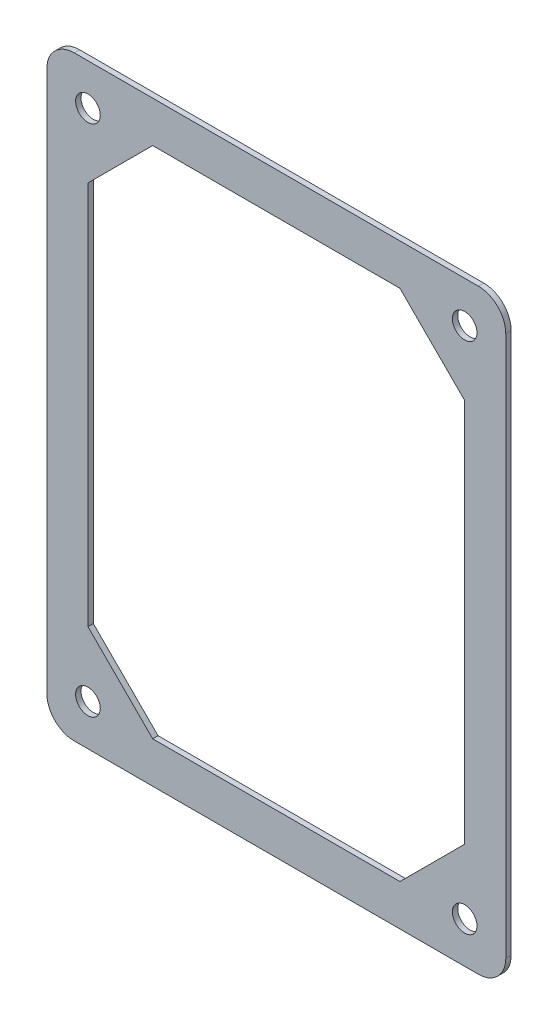
ISO-10303-21;
HEADER;
FILE_DESCRIPTION(('STEP AP214'),'2;1');
FILE_NAME('part.step','',(''),(''),'','','');
FILE_SCHEMA(('AUTOMOTIVE_DESIGN { 1 0 10303 214 1 1 1 1 }'));
ENDSEC;
DATA;
#1=APPLICATION_CONTEXT('core data for automotive mechanical design processes');
#2=APPLICATION_PROTOCOL_DEFINITION('international standard','automotive_design',2000,#1);
#3=PRODUCT_CONTEXT('',#1,'mechanical');
#4=PRODUCT('Part','Part','',(#3));
#5=PRODUCT_RELATED_PRODUCT_CATEGORY('part','',(#4));
#6=PRODUCT_DEFINITION_FORMATION('','',#4);
#7=PRODUCT_DEFINITION_CONTEXT('part definition',#1,'design');
#8=PRODUCT_DEFINITION('design','',#6,#7);
#9=PRODUCT_DEFINITION_SHAPE('','',#8);
#10=(LENGTH_UNIT() NAMED_UNIT(*) SI_UNIT(.MILLI.,.METRE.));
#11=(NAMED_UNIT(*) PLANE_ANGLE_UNIT() SI_UNIT($,.RADIAN.));
#12=(NAMED_UNIT(*) SI_UNIT($,.STERADIAN.) SOLID_ANGLE_UNIT());
#13=UNCERTAINTY_MEASURE_WITH_UNIT(LENGTH_MEASURE(1.E-05),#10,'distance_accuracy_value','');
#14=(GEOMETRIC_REPRESENTATION_CONTEXT(3) GLOBAL_UNCERTAINTY_ASSIGNED_CONTEXT((#13)) GLOBAL_UNIT_ASSIGNED_CONTEXT((#10,
#11,#12)) REPRESENTATION_CONTEXT('',''));
#15=CARTESIAN_POINT('',(0.,0.,0.));
#16=DIRECTION('',(0.,0.,1.));
#17=DIRECTION('',(1.,0.,0.));
#18=AXIS2_PLACEMENT_3D('',#15,#16,#17);
#19=CARTESIAN_POINT('',(-3.81000000000001,-104.14,1.));
#20=DIRECTION('',(0.,0.,1.));
#21=DIRECTION('',(1.,0.,0.));
#22=AXIS2_PLACEMENT_3D('',#19,#20,#21);
#23=PLANE('',#22);
#24=CARTESIAN_POINT('',(-6.35,-6.35,1.));
#25=DIRECTION('',(0.,0.,1.));
#26=DIRECTION('',(1.,0.,0.));
#27=AXIS2_PLACEMENT_3D('',#24,#25,#26);
#28=CIRCLE('',#27,2.286);
#29=CARTESIAN_POINT('',(-4.064,-6.35,1.));
#30=VERTEX_POINT('',#29);
#31=EDGE_CURVE('E211',#30,#30,#28,.T.);
#32=ORIENTED_EDGE('',*,*,#31,.F.);
#33=EDGE_LOOP('',(#32));
#34=FACE_BOUND('',#33,.T.);
#35=CARTESIAN_POINT('',(-76.200000000001,-101.6,1.));
#36=DIRECTION('',(0.,0.,1.));
#37=DIRECTION('',(1.,0.,0.));
#38=AXIS2_PLACEMENT_3D('',#35,#36,#37);
#39=CIRCLE('',#38,2.28600000000001);
#40=CARTESIAN_POINT('',(-73.914000000001,-101.6,1.));
#41=VERTEX_POINT('',#40);
#42=EDGE_CURVE('E223',#41,#41,#39,.T.);
#43=ORIENTED_EDGE('',*,*,#42,.F.);
#44=EDGE_LOOP('',(#43));
#45=FACE_BOUND('',#44,.T.);
#46=CARTESIAN_POINT('',(-3.81000000000001,-104.14,1.));
#47=DIRECTION('',(0.,0.,1.));
#48=DIRECTION('',(1.,0.,0.));
#49=AXIS2_PLACEMENT_3D('',#46,#47,#48);
#50=CIRCLE('',#49,5.08);
#51=CARTESIAN_POINT('',(-3.81000000000001,-109.22,1.));
#52=VERTEX_POINT('',#51);
#53=CARTESIAN_POINT('',(1.26999999999999,-104.14,1.));
#54=VERTEX_POINT('',#53);
#55=EDGE_CURVE('E235',#52,#54,#50,.T.);
#56=ORIENTED_EDGE('',*,*,#55,.T.);
#57=DIRECTION('',(0.,1.,0.));
#58=VECTOR('',#57,1.);
#59=CARTESIAN_POINT('',(1.26999999999999,-104.14,1.));
#60=LINE('',#59,#58);
#61=CARTESIAN_POINT('',(1.27,-3.81,1.));
#62=VERTEX_POINT('',#61);
#63=EDGE_CURVE('E238',#54,#62,#60,.T.);
#64=ORIENTED_EDGE('',*,*,#63,.T.);
#65=CARTESIAN_POINT('',(-3.81,-3.81,1.));
#66=DIRECTION('',(0.,0.,1.));
#67=DIRECTION('',(1.,0.,0.));
#68=AXIS2_PLACEMENT_3D('',#65,#66,#67);
#69=CIRCLE('',#68,5.08);
#70=CARTESIAN_POINT('',(-3.80999999999999,1.27,1.));
#71=VERTEX_POINT('',#70);
#72=EDGE_CURVE('E241',#62,#71,#69,.T.);
#73=ORIENTED_EDGE('',*,*,#72,.T.);
#74=DIRECTION('',(-1.,0.,0.));
#75=VECTOR('',#74,1.);
#76=CARTESIAN_POINT('',(-3.80999999999999,1.27,1.));
#77=LINE('',#76,#75);
#78=CARTESIAN_POINT('',(-78.74,1.27,1.));
#79=VERTEX_POINT('',#78);
#80=EDGE_CURVE('E243',#71,#79,#77,.T.);
#81=ORIENTED_EDGE('',*,*,#80,.T.);
#82=CARTESIAN_POINT('',(-78.74,-3.81,1.));
#83=DIRECTION('',(0.,0.,1.));
#84=DIRECTION('',(1.,0.,0.));
#85=AXIS2_PLACEMENT_3D('',#82,#83,#84);
#86=CIRCLE('',#85,5.08);
#87=CARTESIAN_POINT('',(-83.82,-3.80999999999999,1.));
#88=VERTEX_POINT('',#87);
#89=EDGE_CURVE('E245',#79,#88,#86,.T.);
#90=ORIENTED_EDGE('',*,*,#89,.T.);
#91=DIRECTION('',(0.,-1.,0.));
#92=VECTOR('',#91,1.);
#93=CARTESIAN_POINT('',(-83.82,-3.80999999999999,1.));
#94=LINE('',#93,#92);
#95=CARTESIAN_POINT('',(-83.82,-104.14,1.));
#96=VERTEX_POINT('',#95);
#97=EDGE_CURVE('E247',#88,#96,#94,.T.);
#98=ORIENTED_EDGE('',*,*,#97,.T.);
#99=CARTESIAN_POINT('',(-78.74,-104.14,1.));
#100=DIRECTION('',(0.,0.,1.));
#101=DIRECTION('',(1.,0.,0.));
#102=AXIS2_PLACEMENT_3D('',#99,#100,#101);
#103=CIRCLE('',#102,5.08);
#104=CARTESIAN_POINT('',(-78.74,-109.22,1.));
#105=VERTEX_POINT('',#104);
#106=EDGE_CURVE('E249',#96,#105,#103,.T.);
#107=ORIENTED_EDGE('',*,*,#106,.T.);
#108=DIRECTION('',(1.,0.,0.));
#109=VECTOR('',#108,1.);
#110=CARTESIAN_POINT('',(-78.74,-109.22,1.));
#111=LINE('',#110,#109);
#112=EDGE_CURVE('E251',#105,#52,#111,.T.);
#113=ORIENTED_EDGE('',*,*,#112,.T.);
#114=EDGE_LOOP('',(#56,#64,#73,#81,#90,#98,#107,#113));
#115=FACE_BOUND('',#114,.T.);
#116=CARTESIAN_POINT('',(-76.2,-6.35,1.));
#117=DIRECTION('',(0.,0.,1.));
#118=DIRECTION('',(1.,0.,0.));
#119=AXIS2_PLACEMENT_3D('',#116,#117,#118);
#120=CIRCLE('',#119,2.28600000000001);
#121=CARTESIAN_POINT('',(-73.914,-6.35,1.));
#122=VERTEX_POINT('',#121);
#123=EDGE_CURVE('E229',#122,#122,#120,.T.);
#124=ORIENTED_EDGE('',*,*,#123,.F.);
#125=EDGE_LOOP('',(#124));
#126=FACE_BOUND('',#125,.T.);
#127=CARTESIAN_POINT('',(-6.350000000001,-101.6,1.));
#128=DIRECTION('',(0.,0.,1.));
#129=DIRECTION('',(1.,0.,0.));
#130=AXIS2_PLACEMENT_3D('',#127,#128,#129);
#131=CIRCLE('',#130,2.286);
#132=CARTESIAN_POINT('',(-4.064000000001,-101.6,1.));
#133=VERTEX_POINT('',#132);
#134=EDGE_CURVE('E217',#133,#133,#131,.T.);
#135=ORIENTED_EDGE('',*,*,#134,.F.);
#136=EDGE_LOOP('',(#135));
#137=FACE_BOUND('',#136,.T.);
#138=DIRECTION('',(-0.707106781186551,-0.707106781186544,0.));
#139=VECTOR('',#138,1.);
#140=CARTESIAN_POINT('',(-76.2000000000001,-18.35,1.));
#141=LINE('',#140,#139);
#142=CARTESIAN_POINT('',(-64.2,-6.35,1.));
#143=VERTEX_POINT('',#142);
#144=CARTESIAN_POINT('',(-76.2000000000001,-18.35,1.));
#145=VERTEX_POINT('',#144);
#146=EDGE_CURVE('E154',#143,#145,#141,.T.);
#147=ORIENTED_EDGE('',*,*,#146,.F.);
#148=DIRECTION('',(-1.,0.,0.));
#149=VECTOR('',#148,1.);
#150=CARTESIAN_POINT('',(-64.2,-6.35,1.));
#151=LINE('',#150,#149);
#152=CARTESIAN_POINT('',(-18.35,-6.35,1.));
#153=VERTEX_POINT('',#152);
#154=EDGE_CURVE('E146',#153,#143,#151,.T.);
#155=ORIENTED_EDGE('',*,*,#154,.F.);
#156=DIRECTION('',(-0.707106781186544,0.707106781186551,0.));
#157=VECTOR('',#156,1.);
#158=CARTESIAN_POINT('',(-18.35,-6.35,1.));
#159=LINE('',#158,#157);
#160=CARTESIAN_POINT('',(-6.35000000000013,-18.35,1.));
#161=VERTEX_POINT('',#160);
#162=EDGE_CURVE('E179',#161,#153,#159,.T.);
#163=ORIENTED_EDGE('',*,*,#162,.F.);
#164=DIRECTION('',(0.,1.,0.));
#165=VECTOR('',#164,1.);
#166=CARTESIAN_POINT('',(-6.35000000000013,-18.35,1.));
#167=LINE('',#166,#165);
#168=CARTESIAN_POINT('',(-6.35000000000087,-89.6,1.));
#169=VERTEX_POINT('',#168);
#170=EDGE_CURVE('E177',#169,#161,#167,.T.);
#171=ORIENTED_EDGE('',*,*,#170,.F.);
#172=DIRECTION('',(0.707106781186551,0.707106781186544,0.));
#173=VECTOR('',#172,1.);
#174=CARTESIAN_POINT('',(-18.350000000001,-101.6,1.));
#175=LINE('',#174,#173);
#176=CARTESIAN_POINT('',(-18.350000000001,-101.6,1.));
#177=VERTEX_POINT('',#176);
#178=EDGE_CURVE('E175',#177,#169,#175,.T.);
#179=ORIENTED_EDGE('',*,*,#178,.F.);
#180=DIRECTION('',(1.,0.,0.));
#181=VECTOR('',#180,1.);
#182=CARTESIAN_POINT('',(-64.200000000001,-101.6,1.));
#183=LINE('',#182,#181);
#184=CARTESIAN_POINT('',(-64.200000000001,-101.6,1.));
#185=VERTEX_POINT('',#184);
#186=EDGE_CURVE('E173',#185,#177,#183,.T.);
#187=ORIENTED_EDGE('',*,*,#186,.F.);
#188=DIRECTION('',(0.707106781186544,-0.707106781186551,0.));
#189=VECTOR('',#188,1.);
#190=CARTESIAN_POINT('',(-76.2000000000009,-89.6,1.));
#191=LINE('',#190,#189);
#192=CARTESIAN_POINT('',(-76.2000000000009,-89.6,1.));
#193=VERTEX_POINT('',#192);
#194=EDGE_CURVE('E169',#193,#185,#191,.T.);
#195=ORIENTED_EDGE('',*,*,#194,.F.);
#196=DIRECTION('',(0.,-1.,0.));
#197=VECTOR('',#196,1.);
#198=CARTESIAN_POINT('',(-76.2000000000001,-18.35,1.));
#199=LINE('',#198,#197);
#200=EDGE_CURVE('E167',#145,#193,#199,.T.);
#201=ORIENTED_EDGE('',*,*,#200,.F.);
#202=EDGE_LOOP('',(#147,#155,#163,#171,#179,#187,#195,#201));
#203=FACE_BOUND('',#202,.T.);
#204=ADVANCED_FACE('F33',(#34,#45,#115,#126,#137,#203),#23,.T.);
#205=CARTESIAN_POINT('',(-3.81000000000001,-104.14,0.));
#206=DIRECTION('',(0.,0.,1.));
#207=DIRECTION('',(1.,0.,0.));
#208=AXIS2_PLACEMENT_3D('',#205,#206,#207);
#209=PLANE('',#208);
#210=CARTESIAN_POINT('',(-6.35,-6.35,0.));
#211=DIRECTION('',(0.,0.,1.));
#212=DIRECTION('',(1.,0.,0.));
#213=AXIS2_PLACEMENT_3D('',#210,#211,#212);
#214=CIRCLE('',#213,2.286);
#215=CARTESIAN_POINT('',(-4.064,-6.35,0.));
#216=VERTEX_POINT('',#215);
#217=EDGE_CURVE('E162',#216,#216,#214,.T.);
#218=ORIENTED_EDGE('',*,*,#217,.T.);
#219=EDGE_LOOP('',(#218));
#220=FACE_BOUND('',#219,.T.);
#221=CARTESIAN_POINT('',(-76.200000000001,-101.6,0.));
#222=DIRECTION('',(0.,0.,1.));
#223=DIRECTION('',(1.,0.,0.));
#224=AXIS2_PLACEMENT_3D('',#221,#222,#223);
#225=CIRCLE('',#224,2.28600000000001);
#226=CARTESIAN_POINT('',(-73.914000000001,-101.6,0.));
#227=VERTEX_POINT('',#226);
#228=EDGE_CURVE('E220',#227,#227,#225,.T.);
#229=ORIENTED_EDGE('',*,*,#228,.T.);
#230=EDGE_LOOP('',(#229));
#231=FACE_BOUND('',#230,.T.);
#232=CARTESIAN_POINT('',(-3.81000000000001,-104.14,0.));
#233=DIRECTION('',(0.,0.,1.));
#234=DIRECTION('',(1.,0.,0.));
#235=AXIS2_PLACEMENT_3D('',#232,#233,#234);
#236=CIRCLE('',#235,5.08);
#237=CARTESIAN_POINT('',(-3.81000000000001,-109.22,0.));
#238=VERTEX_POINT('',#237);
#239=CARTESIAN_POINT('',(1.26999999999999,-104.14,0.));
#240=VERTEX_POINT('',#239);
#241=EDGE_CURVE('E232',#238,#240,#236,.T.);
#242=ORIENTED_EDGE('',*,*,#241,.F.);
#243=DIRECTION('',(1.,0.,0.));
#244=VECTOR('',#243,1.);
#245=CARTESIAN_POINT('',(-78.74,-109.22,0.));
#246=LINE('',#245,#244);
#247=CARTESIAN_POINT('',(-78.74,-109.22,0.));
#248=VERTEX_POINT('',#247);
#249=EDGE_CURVE('E239',#248,#238,#246,.T.);
#250=ORIENTED_EDGE('',*,*,#249,.F.);
#251=CARTESIAN_POINT('',(-78.74,-104.14,0.));
#252=DIRECTION('',(0.,0.,1.));
#253=DIRECTION('',(1.,0.,0.));
#254=AXIS2_PLACEMENT_3D('',#251,#252,#253);
#255=CIRCLE('',#254,5.08);
#256=CARTESIAN_POINT('',(-83.82,-104.14,0.));
#257=VERTEX_POINT('',#256);
#258=EDGE_CURVE('E266',#257,#248,#255,.T.);
#259=ORIENTED_EDGE('',*,*,#258,.F.);
#260=DIRECTION('',(0.,-1.,0.));
#261=VECTOR('',#260,1.);
#262=CARTESIAN_POINT('',(-83.82,-3.80999999999999,0.));
#263=LINE('',#262,#261);
#264=CARTESIAN_POINT('',(-83.82,-3.80999999999999,0.));
#265=VERTEX_POINT('',#264);
#266=EDGE_CURVE('E264',#265,#257,#263,.T.);
#267=ORIENTED_EDGE('',*,*,#266,.F.);
#268=CARTESIAN_POINT('',(-78.74,-3.81,0.));
#269=DIRECTION('',(0.,0.,1.));
#270=DIRECTION('',(1.,0.,0.));
#271=AXIS2_PLACEMENT_3D('',#268,#269,#270);
#272=CIRCLE('',#271,5.08);
#273=CARTESIAN_POINT('',(-78.74,1.27,0.));
#274=VERTEX_POINT('',#273);
#275=EDGE_CURVE('E262',#274,#265,#272,.T.);
#276=ORIENTED_EDGE('',*,*,#275,.F.);
#277=DIRECTION('',(-1.,0.,0.));
#278=VECTOR('',#277,1.);
#279=CARTESIAN_POINT('',(-3.80999999999999,1.27,0.));
#280=LINE('',#279,#278);
#281=CARTESIAN_POINT('',(-3.80999999999999,1.27,0.));
#282=VERTEX_POINT('',#281);
#283=EDGE_CURVE('E260',#282,#274,#280,.T.);
#284=ORIENTED_EDGE('',*,*,#283,.F.);
#285=CARTESIAN_POINT('',(-3.81,-3.81,0.));
#286=DIRECTION('',(0.,0.,1.));
#287=DIRECTION('',(1.,0.,0.));
#288=AXIS2_PLACEMENT_3D('',#285,#286,#287);
#289=CIRCLE('',#288,5.08);
#290=CARTESIAN_POINT('',(1.27,-3.81,0.));
#291=VERTEX_POINT('',#290);
#292=EDGE_CURVE('E258',#291,#282,#289,.T.);
#293=ORIENTED_EDGE('',*,*,#292,.F.);
#294=DIRECTION('',(0.,1.,0.));
#295=VECTOR('',#294,1.);
#296=CARTESIAN_POINT('',(1.26999999999999,-104.14,0.));
#297=LINE('',#296,#295);
#298=EDGE_CURVE('E256',#240,#291,#297,.T.);
#299=ORIENTED_EDGE('',*,*,#298,.F.);
#300=EDGE_LOOP('',(#242,#250,#259,#267,#276,#284,#293,#299));
#301=FACE_BOUND('',#300,.T.);
#302=CARTESIAN_POINT('',(-76.2,-6.35,0.));
#303=DIRECTION('',(0.,0.,1.));
#304=DIRECTION('',(1.,0.,0.));
#305=AXIS2_PLACEMENT_3D('',#302,#303,#304);
#306=CIRCLE('',#305,2.28600000000001);
#307=CARTESIAN_POINT('',(-73.914,-6.35,0.));
#308=VERTEX_POINT('',#307);
#309=EDGE_CURVE('E226',#308,#308,#306,.T.);
#310=ORIENTED_EDGE('',*,*,#309,.T.);
#311=EDGE_LOOP('',(#310));
#312=FACE_BOUND('',#311,.T.);
#313=CARTESIAN_POINT('',(-6.350000000001,-101.6,0.));
#314=DIRECTION('',(0.,0.,1.));
#315=DIRECTION('',(1.,0.,0.));
#316=AXIS2_PLACEMENT_3D('',#313,#314,#315);
#317=CIRCLE('',#316,2.286);
#318=CARTESIAN_POINT('',(-4.064000000001,-101.6,0.));
#319=VERTEX_POINT('',#318);
#320=EDGE_CURVE('E214',#319,#319,#317,.T.);
#321=ORIENTED_EDGE('',*,*,#320,.T.);
#322=EDGE_LOOP('',(#321));
#323=FACE_BOUND('',#322,.T.);
#324=DIRECTION('',(-1.,0.,0.));
#325=VECTOR('',#324,1.);
#326=CARTESIAN_POINT('',(-64.2,-6.35,0.));
#327=LINE('',#326,#325);
#328=CARTESIAN_POINT('',(-18.35,-6.35000000000001,0.));
#329=VERTEX_POINT('',#328);
#330=CARTESIAN_POINT('',(-64.2,-6.35,0.));
#331=VERTEX_POINT('',#330);
#332=EDGE_CURVE('E56',#329,#331,#327,.T.);
#333=ORIENTED_EDGE('',*,*,#332,.T.);
#334=DIRECTION('',(-0.707106781186551,-0.707106781186544,0.));
#335=VECTOR('',#334,1.);
#336=CARTESIAN_POINT('',(-76.2000000000001,-18.35,0.));
#337=LINE('',#336,#335);
#338=CARTESIAN_POINT('',(-76.2000000000001,-18.35,0.));
#339=VERTEX_POINT('',#338);
#340=EDGE_CURVE('E161',#331,#339,#337,.T.);
#341=ORIENTED_EDGE('',*,*,#340,.T.);
#342=DIRECTION('',(0.,-1.,0.));
#343=VECTOR('',#342,1.);
#344=CARTESIAN_POINT('',(-76.2000000000001,-18.35,0.));
#345=LINE('',#344,#343);
#346=CARTESIAN_POINT('',(-76.2000000000009,-89.6,0.));
#347=VERTEX_POINT('',#346);
#348=EDGE_CURVE('E183',#339,#347,#345,.T.);
#349=ORIENTED_EDGE('',*,*,#348,.T.);
#350=DIRECTION('',(0.707106781186544,-0.707106781186551,0.));
#351=VECTOR('',#350,1.);
#352=CARTESIAN_POINT('',(-76.2000000000009,-89.6,0.));
#353=LINE('',#352,#351);
#354=CARTESIAN_POINT('',(-64.200000000001,-101.6,0.));
#355=VERTEX_POINT('',#354);
#356=EDGE_CURVE('E186',#347,#355,#353,.T.);
#357=ORIENTED_EDGE('',*,*,#356,.T.);
#358=DIRECTION('',(1.,0.,0.));
#359=VECTOR('',#358,1.);
#360=CARTESIAN_POINT('',(-64.200000000001,-101.6,0.));
#361=LINE('',#360,#359);
#362=CARTESIAN_POINT('',(-18.350000000001,-101.6,0.));
#363=VERTEX_POINT('',#362);
#364=EDGE_CURVE('E189',#355,#363,#361,.T.);
#365=ORIENTED_EDGE('',*,*,#364,.T.);
#366=DIRECTION('',(0.707106781186551,0.707106781186544,0.));
#367=VECTOR('',#366,1.);
#368=CARTESIAN_POINT('',(-18.350000000001,-101.6,0.));
#369=LINE('',#368,#367);
#370=CARTESIAN_POINT('',(-6.35000000000087,-89.6,0.));
#371=VERTEX_POINT('',#370);
#372=EDGE_CURVE('E192',#363,#371,#369,.T.);
#373=ORIENTED_EDGE('',*,*,#372,.T.);
#374=DIRECTION('',(0.,1.,0.));
#375=VECTOR('',#374,1.);
#376=CARTESIAN_POINT('',(-6.35000000000013,-18.35,0.));
#377=LINE('',#376,#375);
#378=CARTESIAN_POINT('',(-6.35000000000013,-18.35,0.));
#379=VERTEX_POINT('',#378);
#380=EDGE_CURVE('E195',#371,#379,#377,.T.);
#381=ORIENTED_EDGE('',*,*,#380,.T.);
#382=DIRECTION('',(-0.707106781186544,0.707106781186551,0.));
#383=VECTOR('',#382,1.);
#384=CARTESIAN_POINT('',(-18.35,-6.35,0.));
#385=LINE('',#384,#383);
#386=EDGE_CURVE('E155',#379,#329,#385,.T.);
#387=ORIENTED_EDGE('',*,*,#386,.T.);
#388=EDGE_LOOP('',(#333,#341,#349,#357,#365,#373,#381,#387));
#389=FACE_BOUND('',#388,.T.);
#390=ADVANCED_FACE('F296',(#220,#231,#301,#312,#323,#389),#209,.F.);
#391=CARTESIAN_POINT('',(-3.81000000000001,-104.14,1.));
#392=DIRECTION('',(0.,0.,-1.));
#393=DIRECTION('',(-1.,0.,0.));
#394=AXIS2_PLACEMENT_3D('',#391,#392,#393);
#395=CYLINDRICAL_SURFACE('',#394,5.08);
#396=ORIENTED_EDGE('',*,*,#241,.T.);
#397=DIRECTION('',(0.,0.,-1.));
#398=VECTOR('',#397,1.);
#399=CARTESIAN_POINT('',(1.26999999999999,-104.14,1.));
#400=LINE('',#399,#398);
#401=EDGE_CURVE('E11',#54,#240,#400,.T.);
#402=ORIENTED_EDGE('',*,*,#401,.F.);
#403=ORIENTED_EDGE('',*,*,#55,.F.);
#404=DIRECTION('',(0.,0.,-1.));
#405=VECTOR('',#404,1.);
#406=CARTESIAN_POINT('',(-3.81000000000001,-109.22,1.));
#407=LINE('',#406,#405);
#408=EDGE_CURVE('E253',#52,#238,#407,.T.);
#409=ORIENTED_EDGE('',*,*,#408,.T.);
#410=EDGE_LOOP('',(#396,#402,#403,#409));
#411=FACE_BOUND('',#410,.T.);
#412=ADVANCED_FACE('F35',(#411),#395,.T.);
#413=CARTESIAN_POINT('',(1.26999999999999,-104.14,1.));
#414=DIRECTION('',(-1.,0.,0.));
#415=DIRECTION('',(0.,-1.,0.));
#416=AXIS2_PLACEMENT_3D('',#413,#414,#415);
#417=PLANE('',#416);
#418=ORIENTED_EDGE('',*,*,#298,.T.);
#419=DIRECTION('',(0.,0.,-1.));
#420=VECTOR('',#419,1.);
#421=CARTESIAN_POINT('',(1.27,-3.81,1.));
#422=LINE('',#421,#420);
#423=EDGE_CURVE('E41',#62,#291,#422,.T.);
#424=ORIENTED_EDGE('',*,*,#423,.F.);
#425=ORIENTED_EDGE('',*,*,#63,.F.);
#426=ORIENTED_EDGE('',*,*,#401,.T.);
#427=EDGE_LOOP('',(#418,#424,#425,#426));
#428=FACE_BOUND('',#427,.T.);
#429=ADVANCED_FACE('F314',(#428),#417,.F.);
#430=CARTESIAN_POINT('',(-3.81,-3.81,1.));
#431=DIRECTION('',(0.,0.,-1.));
#432=DIRECTION('',(-1.,0.,0.));
#433=AXIS2_PLACEMENT_3D('',#430,#431,#432);
#434=CYLINDRICAL_SURFACE('',#433,5.08);
#435=ORIENTED_EDGE('',*,*,#292,.T.);
#436=DIRECTION('',(0.,0.,-1.));
#437=VECTOR('',#436,1.);
#438=CARTESIAN_POINT('',(-3.80999999999999,1.27,1.));
#439=LINE('',#438,#437);
#440=EDGE_CURVE('E283',#71,#282,#439,.T.);
#441=ORIENTED_EDGE('',*,*,#440,.F.);
#442=ORIENTED_EDGE('',*,*,#72,.F.);
#443=ORIENTED_EDGE('',*,*,#423,.T.);
#444=EDGE_LOOP('',(#435,#441,#442,#443));
#445=FACE_BOUND('',#444,.T.);
#446=ADVANCED_FACE('F290',(#445),#434,.T.);
#447=CARTESIAN_POINT('',(-3.80999999999999,1.27,1.));
#448=DIRECTION('',(0.,-1.,0.));
#449=DIRECTION('',(0.,0.,-1.));
#450=AXIS2_PLACEMENT_3D('',#447,#448,#449);
#451=PLANE('',#450);
#452=ORIENTED_EDGE('',*,*,#283,.T.);
#453=DIRECTION('',(0.,0.,-1.));
#454=VECTOR('',#453,1.);
#455=CARTESIAN_POINT('',(-78.74,1.27,1.));
#456=LINE('',#455,#454);
#457=EDGE_CURVE('E280',#79,#274,#456,.T.);
#458=ORIENTED_EDGE('',*,*,#457,.F.);
#459=ORIENTED_EDGE('',*,*,#80,.F.);
#460=ORIENTED_EDGE('',*,*,#440,.T.);
#461=EDGE_LOOP('',(#452,#458,#459,#460));
#462=FACE_BOUND('',#461,.T.);
#463=ADVANCED_FACE('F302',(#462),#451,.F.);
#464=CARTESIAN_POINT('',(-78.74,-3.81,1.));
#465=DIRECTION('',(0.,0.,-1.));
#466=DIRECTION('',(-1.,0.,0.));
#467=AXIS2_PLACEMENT_3D('',#464,#465,#466);
#468=CYLINDRICAL_SURFACE('',#467,5.08);
#469=ORIENTED_EDGE('',*,*,#275,.T.);
#470=DIRECTION('',(0.,0.,-1.));
#471=VECTOR('',#470,1.);
#472=CARTESIAN_POINT('',(-83.82,-3.80999999999999,1.));
#473=LINE('',#472,#471);
#474=EDGE_CURVE('E277',#88,#265,#473,.T.);
#475=ORIENTED_EDGE('',*,*,#474,.F.);
#476=ORIENTED_EDGE('',*,*,#89,.F.);
#477=ORIENTED_EDGE('',*,*,#457,.T.);
#478=EDGE_LOOP('',(#469,#475,#476,#477));
#479=FACE_BOUND('',#478,.T.);
#480=ADVANCED_FACE('F306',(#479),#468,.T.);
#481=CARTESIAN_POINT('',(-83.82,-3.80999999999999,1.));
#482=DIRECTION('',(1.,0.,0.));
#483=DIRECTION('',(0.,1.,0.));
#484=AXIS2_PLACEMENT_3D('',#481,#482,#483);
#485=PLANE('',#484);
#486=ORIENTED_EDGE('',*,*,#266,.T.);
#487=DIRECTION('',(0.,0.,-1.));
#488=VECTOR('',#487,1.);
#489=CARTESIAN_POINT('',(-83.82,-104.14,1.));
#490=LINE('',#489,#488);
#491=EDGE_CURVE('E274',#96,#257,#490,.T.);
#492=ORIENTED_EDGE('',*,*,#491,.F.);
#493=ORIENTED_EDGE('',*,*,#97,.F.);
#494=ORIENTED_EDGE('',*,*,#474,.T.);
#495=EDGE_LOOP('',(#486,#492,#493,#494));
#496=FACE_BOUND('',#495,.T.);
#497=ADVANCED_FACE('F327',(#496),#485,.F.);
#498=CARTESIAN_POINT('',(-78.74,-104.14,1.));
#499=DIRECTION('',(0.,0.,-1.));
#500=DIRECTION('',(-1.,0.,0.));
#501=AXIS2_PLACEMENT_3D('',#498,#499,#500);
#502=CYLINDRICAL_SURFACE('',#501,5.08);
#503=ORIENTED_EDGE('',*,*,#258,.T.);
#504=DIRECTION('',(0.,0.,-1.));
#505=VECTOR('',#504,1.);
#506=CARTESIAN_POINT('',(-78.74,-109.22,1.));
#507=LINE('',#506,#505);
#508=EDGE_CURVE('E271',#105,#248,#507,.T.);
#509=ORIENTED_EDGE('',*,*,#508,.F.);
#510=ORIENTED_EDGE('',*,*,#106,.F.);
#511=ORIENTED_EDGE('',*,*,#491,.T.);
#512=EDGE_LOOP('',(#503,#509,#510,#511));
#513=FACE_BOUND('',#512,.T.);
#514=ADVANCED_FACE('F325',(#513),#502,.T.);
#515=CARTESIAN_POINT('',(-78.74,-109.22,1.));
#516=DIRECTION('',(0.,1.,0.));
#517=DIRECTION('',(0.,0.,1.));
#518=AXIS2_PLACEMENT_3D('',#515,#516,#517);
#519=PLANE('',#518);
#520=ORIENTED_EDGE('',*,*,#249,.T.);
#521=ORIENTED_EDGE('',*,*,#408,.F.);
#522=ORIENTED_EDGE('',*,*,#112,.F.);
#523=ORIENTED_EDGE('',*,*,#508,.T.);
#524=EDGE_LOOP('',(#520,#521,#522,#523));
#525=FACE_BOUND('',#524,.T.);
#526=ADVANCED_FACE('F320',(#525),#519,.F.);
#527=CARTESIAN_POINT('',(-76.2,-6.35,1.));
#528=DIRECTION('',(0.,0.,-1.));
#529=DIRECTION('',(-1.,0.,0.));
#530=AXIS2_PLACEMENT_3D('',#527,#528,#529);
#531=CYLINDRICAL_SURFACE('',#530,2.28600000000001);
#532=ORIENTED_EDGE('',*,*,#123,.T.);
#533=EDGE_LOOP('',(#532));
#534=FACE_BOUND('',#533,.T.);
#535=ORIENTED_EDGE('',*,*,#309,.F.);
#536=EDGE_LOOP('',(#535));
#537=FACE_BOUND('',#536,.T.);
#538=ADVANCED_FACE('F347',(#534,#537),#531,.F.);
#539=CARTESIAN_POINT('',(-76.200000000001,-101.6,1.));
#540=DIRECTION('',(0.,0.,-1.));
#541=DIRECTION('',(-1.,0.,0.));
#542=AXIS2_PLACEMENT_3D('',#539,#540,#541);
#543=CYLINDRICAL_SURFACE('',#542,2.28600000000001);
#544=ORIENTED_EDGE('',*,*,#42,.T.);
#545=EDGE_LOOP('',(#544));
#546=FACE_BOUND('',#545,.T.);
#547=ORIENTED_EDGE('',*,*,#228,.F.);
#548=EDGE_LOOP('',(#547));
#549=FACE_BOUND('',#548,.T.);
#550=ADVANCED_FACE('F354',(#546,#549),#543,.F.);
#551=CARTESIAN_POINT('',(-6.350000000001,-101.6,1.));
#552=DIRECTION('',(0.,0.,-1.));
#553=DIRECTION('',(-1.,0.,0.));
#554=AXIS2_PLACEMENT_3D('',#551,#552,#553);
#555=CYLINDRICAL_SURFACE('',#554,2.286);
#556=ORIENTED_EDGE('',*,*,#134,.T.);
#557=EDGE_LOOP('',(#556));
#558=FACE_BOUND('',#557,.T.);
#559=ORIENTED_EDGE('',*,*,#320,.F.);
#560=EDGE_LOOP('',(#559));
#561=FACE_BOUND('',#560,.T.);
#562=ADVANCED_FACE('F359',(#558,#561),#555,.F.);
#563=CARTESIAN_POINT('',(-6.35,-6.35,1.));
#564=DIRECTION('',(0.,0.,-1.));
#565=DIRECTION('',(-1.,0.,0.));
#566=AXIS2_PLACEMENT_3D('',#563,#564,#565);
#567=CYLINDRICAL_SURFACE('',#566,2.286);
#568=ORIENTED_EDGE('',*,*,#31,.T.);
#569=EDGE_LOOP('',(#568));
#570=FACE_BOUND('',#569,.T.);
#571=ORIENTED_EDGE('',*,*,#217,.F.);
#572=EDGE_LOOP('',(#571));
#573=FACE_BOUND('',#572,.T.);
#574=ADVANCED_FACE('F402',(#570,#573),#567,.F.);
#575=CARTESIAN_POINT('',(-64.2,-6.35,1.));
#576=DIRECTION('',(0.,-1.,0.));
#577=DIRECTION('',(0.,0.,-1.));
#578=AXIS2_PLACEMENT_3D('',#575,#576,#577);
#579=PLANE('',#578);
#580=ORIENTED_EDGE('',*,*,#332,.F.);
#581=DIRECTION('',(0.,0.,-1.));
#582=VECTOR('',#581,1.);
#583=CARTESIAN_POINT('',(-18.35,-6.35,1.));
#584=LINE('',#583,#582);
#585=EDGE_CURVE('E150',#153,#329,#584,.T.);
#586=ORIENTED_EDGE('',*,*,#585,.F.);
#587=ORIENTED_EDGE('',*,*,#154,.T.);
#588=DIRECTION('',(0.,0.,-1.));
#589=VECTOR('',#588,1.);
#590=CARTESIAN_POINT('',(-64.2,-6.35,1.));
#591=LINE('',#590,#589);
#592=EDGE_CURVE('E149',#143,#331,#591,.T.);
#593=ORIENTED_EDGE('',*,*,#592,.T.);
#594=EDGE_LOOP('',(#580,#586,#587,#593));
#595=FACE_BOUND('',#594,.T.);
#596=ADVANCED_FACE('F148',(#595),#579,.T.);
#597=CARTESIAN_POINT('',(-76.2000000000001,-18.35,1.));
#598=DIRECTION('',(0.707106781186544,-0.707106781186551,0.));
#599=DIRECTION('',(0.707106781186551,0.707106781186544,0.));
#600=AXIS2_PLACEMENT_3D('',#597,#598,#599);
#601=PLANE('',#600);
#602=ORIENTED_EDGE('',*,*,#340,.F.);
#603=ORIENTED_EDGE('',*,*,#592,.F.);
#604=ORIENTED_EDGE('',*,*,#146,.T.);
#605=DIRECTION('',(0.,0.,-1.));
#606=VECTOR('',#605,1.);
#607=CARTESIAN_POINT('',(-76.2000000000001,-18.35,1.));
#608=LINE('',#607,#606);
#609=EDGE_CURVE('E163',#145,#339,#608,.T.);
#610=ORIENTED_EDGE('',*,*,#609,.T.);
#611=EDGE_LOOP('',(#602,#603,#604,#610));
#612=FACE_BOUND('',#611,.T.);
#613=ADVANCED_FACE('F158',(#612),#601,.T.);
#614=CARTESIAN_POINT('',(-76.2000000000001,-18.35,1.));
#615=DIRECTION('',(1.,0.,0.));
#616=DIRECTION('',(0.,1.,0.));
#617=AXIS2_PLACEMENT_3D('',#614,#615,#616);
#618=PLANE('',#617);
#619=ORIENTED_EDGE('',*,*,#348,.F.);
#620=ORIENTED_EDGE('',*,*,#609,.F.);
#621=ORIENTED_EDGE('',*,*,#200,.T.);
#622=DIRECTION('',(0.,0.,-1.));
#623=VECTOR('',#622,1.);
#624=CARTESIAN_POINT('',(-76.2000000000009,-89.6,1.));
#625=LINE('',#624,#623);
#626=EDGE_CURVE('E208',#193,#347,#625,.T.);
#627=ORIENTED_EDGE('',*,*,#626,.T.);
#628=EDGE_LOOP('',(#619,#620,#621,#627));
#629=FACE_BOUND('',#628,.T.);
#630=ADVANCED_FACE('F389',(#629),#618,.T.);
#631=CARTESIAN_POINT('',(-76.2000000000009,-89.6,1.));
#632=DIRECTION('',(0.707106781186551,0.707106781186544,0.));
#633=DIRECTION('',(-0.707106781186544,0.707106781186551,0.));
#634=AXIS2_PLACEMENT_3D('',#631,#632,#633);
#635=PLANE('',#634);
#636=ORIENTED_EDGE('',*,*,#356,.F.);
#637=ORIENTED_EDGE('',*,*,#626,.F.);
#638=ORIENTED_EDGE('',*,*,#194,.T.);
#639=DIRECTION('',(0.,0.,-1.));
#640=VECTOR('',#639,1.);
#641=CARTESIAN_POINT('',(-64.200000000001,-101.6,1.));
#642=LINE('',#641,#640);
#643=EDGE_CURVE('E206',#185,#355,#642,.T.);
#644=ORIENTED_EDGE('',*,*,#643,.T.);
#645=EDGE_LOOP('',(#636,#637,#638,#644));
#646=FACE_BOUND('',#645,.T.);
#647=ADVANCED_FACE('F386',(#646),#635,.T.);
#648=CARTESIAN_POINT('',(-64.200000000001,-101.6,1.));
#649=DIRECTION('',(0.,1.,0.));
#650=DIRECTION('',(0.,0.,1.));
#651=AXIS2_PLACEMENT_3D('',#648,#649,#650);
#652=PLANE('',#651);
#653=ORIENTED_EDGE('',*,*,#364,.F.);
#654=ORIENTED_EDGE('',*,*,#643,.F.);
#655=ORIENTED_EDGE('',*,*,#186,.T.);
#656=DIRECTION('',(0.,0.,-1.));
#657=VECTOR('',#656,1.);
#658=CARTESIAN_POINT('',(-18.350000000001,-101.6,1.));
#659=LINE('',#658,#657);
#660=EDGE_CURVE('E204',#177,#363,#659,.T.);
#661=ORIENTED_EDGE('',*,*,#660,.T.);
#662=EDGE_LOOP('',(#653,#654,#655,#661));
#663=FACE_BOUND('',#662,.T.);
#664=ADVANCED_FACE('F381',(#663),#652,.T.);
#665=CARTESIAN_POINT('',(-18.350000000001,-101.6,1.));
#666=DIRECTION('',(-0.707106781186544,0.707106781186551,0.));
#667=DIRECTION('',(-0.707106781186551,-0.707106781186544,0.));
#668=AXIS2_PLACEMENT_3D('',#665,#666,#667);
#669=PLANE('',#668);
#670=ORIENTED_EDGE('',*,*,#372,.F.);
#671=ORIENTED_EDGE('',*,*,#660,.F.);
#672=ORIENTED_EDGE('',*,*,#178,.T.);
#673=DIRECTION('',(0.,0.,-1.));
#674=VECTOR('',#673,1.);
#675=CARTESIAN_POINT('',(-6.35000000000087,-89.6,1.));
#676=LINE('',#675,#674);
#677=EDGE_CURVE('E202',#169,#371,#676,.T.);
#678=ORIENTED_EDGE('',*,*,#677,.T.);
#679=EDGE_LOOP('',(#670,#671,#672,#678));
#680=FACE_BOUND('',#679,.T.);
#681=ADVANCED_FACE('F377',(#680),#669,.T.);
#682=CARTESIAN_POINT('',(-6.35000000000013,-18.35,1.));
#683=DIRECTION('',(-1.,0.,0.));
#684=DIRECTION('',(0.,-1.,0.));
#685=AXIS2_PLACEMENT_3D('',#682,#683,#684);
#686=PLANE('',#685);
#687=ORIENTED_EDGE('',*,*,#380,.F.);
#688=ORIENTED_EDGE('',*,*,#677,.F.);
#689=ORIENTED_EDGE('',*,*,#170,.T.);
#690=DIRECTION('',(0.,0.,-1.));
#691=VECTOR('',#690,1.);
#692=CARTESIAN_POINT('',(-6.35000000000013,-18.35,1.));
#693=LINE('',#692,#691);
#694=EDGE_CURVE('E48',#161,#379,#693,.T.);
#695=ORIENTED_EDGE('',*,*,#694,.T.);
#696=EDGE_LOOP('',(#687,#688,#689,#695));
#697=FACE_BOUND('',#696,.T.);
#698=ADVANCED_FACE('F374',(#697),#686,.T.);
#699=CARTESIAN_POINT('',(-18.35,-6.35,1.));
#700=DIRECTION('',(-0.707106781186551,-0.707106781186544,0.));
#701=DIRECTION('',(0.707106781186544,-0.707106781186551,0.));
#702=AXIS2_PLACEMENT_3D('',#699,#700,#701);
#703=PLANE('',#702);
#704=ORIENTED_EDGE('',*,*,#386,.F.);
#705=ORIENTED_EDGE('',*,*,#694,.F.);
#706=ORIENTED_EDGE('',*,*,#162,.T.);
#707=ORIENTED_EDGE('',*,*,#585,.T.);
#708=EDGE_LOOP('',(#704,#705,#706,#707));
#709=FACE_BOUND('',#708,.T.);
#710=ADVANCED_FACE('F368',(#709),#703,.T.);
#711=CLOSED_SHELL('',(#204,#390,#412,#429,#446,#463,#480,#497,#514,#526,#538,#550,#562,#574,
#596,#613,#630,#647,#664,#681,#698,#710));
#712=MANIFOLD_SOLID_BREP('B2',#711);
#713=ADVANCED_BREP_SHAPE_REPRESENTATION('',(#18,#712),#14);
#714=SHAPE_DEFINITION_REPRESENTATION(#9,#713);
ENDSEC;
END-ISO-10303-21;
